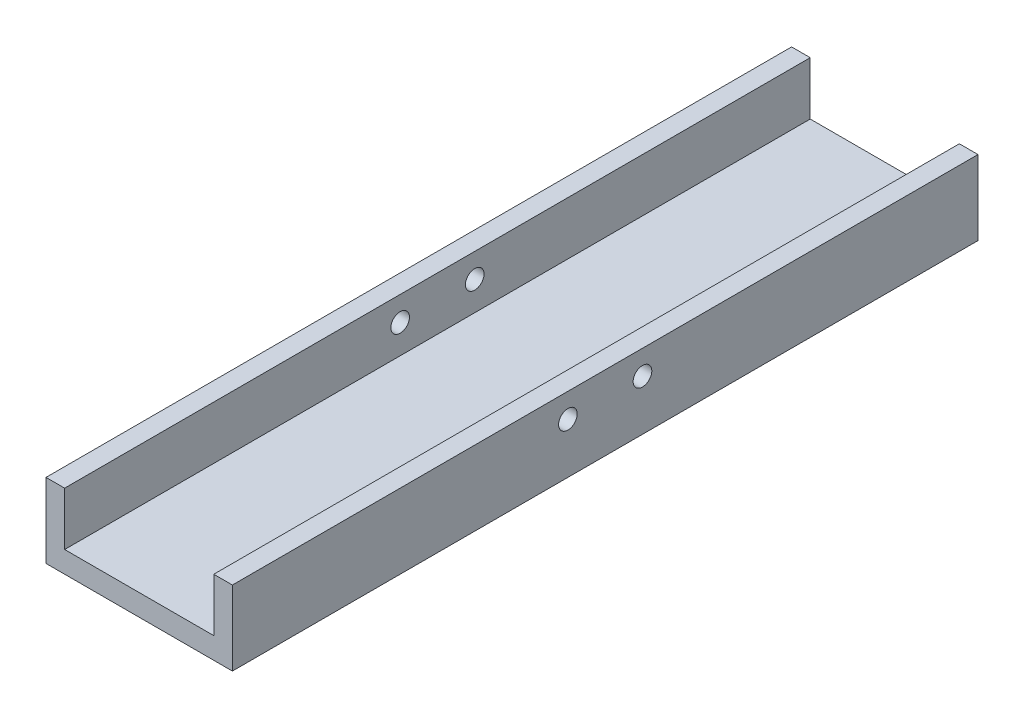
ISO-10303-21;
HEADER;
FILE_DESCRIPTION(('STEP AP214'),'2;1');
FILE_NAME('part.step','',(''),(''),'','','');
FILE_SCHEMA(('AUTOMOTIVE_DESIGN { 1 0 10303 214 1 1 1 1 }'));
ENDSEC;
DATA;
#1=APPLICATION_CONTEXT('core data for automotive mechanical design processes');
#2=APPLICATION_PROTOCOL_DEFINITION('international standard','automotive_design',2000,#1);
#3=PRODUCT_CONTEXT('',#1,'mechanical');
#4=PRODUCT('Part','Part','',(#3));
#5=PRODUCT_RELATED_PRODUCT_CATEGORY('part','',(#4));
#6=PRODUCT_DEFINITION_FORMATION('','',#4);
#7=PRODUCT_DEFINITION_CONTEXT('part definition',#1,'design');
#8=PRODUCT_DEFINITION('design','',#6,#7);
#9=PRODUCT_DEFINITION_SHAPE('','',#8);
#10=(LENGTH_UNIT() NAMED_UNIT(*) SI_UNIT(.MILLI.,.METRE.));
#11=(NAMED_UNIT(*) PLANE_ANGLE_UNIT() SI_UNIT($,.RADIAN.));
#12=(NAMED_UNIT(*) SI_UNIT($,.STERADIAN.) SOLID_ANGLE_UNIT());
#13=UNCERTAINTY_MEASURE_WITH_UNIT(LENGTH_MEASURE(1.E-05),#10,'distance_accuracy_value','');
#14=(GEOMETRIC_REPRESENTATION_CONTEXT(3) GLOBAL_UNCERTAINTY_ASSIGNED_CONTEXT((#13)) GLOBAL_UNIT_ASSIGNED_CONTEXT((#10,
#11,#12)) REPRESENTATION_CONTEXT('',''));
#15=CARTESIAN_POINT('',(0.,0.,0.));
#16=DIRECTION('',(0.,0.,1.));
#17=DIRECTION('',(1.,0.,0.));
#18=AXIS2_PLACEMENT_3D('',#15,#16,#17);
#19=CARTESIAN_POINT('',(-4.65787214121234,4.25514792018293,200.));
#20=DIRECTION('',(0.,-1.,0.));
#21=DIRECTION('',(0.,0.,-1.));
#22=AXIS2_PLACEMENT_3D('',#19,#20,#21);
#23=PLANE('',#22);
#24=DIRECTION('',(-1.,0.,0.));
#25=VECTOR('',#24,1.);
#26=CARTESIAN_POINT('',(-4.65787214121234,4.25514792018293,0.));
#27=LINE('',#26,#25);
#28=CARTESIAN_POINT('',(45.3421278587877,4.25514792018293,0.));
#29=VERTEX_POINT('',#28);
#30=CARTESIAN_POINT('',(40.3421278587877,4.25514792018293,0.));
#31=VERTEX_POINT('',#30);
#32=EDGE_CURVE('E183',#29,#31,#27,.T.);
#33=ORIENTED_EDGE('',*,*,#32,.T.);
#34=DIRECTION('',(0.,0.,1.));
#35=VECTOR('',#34,1.);
#36=CARTESIAN_POINT('',(40.3421278587877,4.25514792018293,200.));
#37=LINE('',#36,#35);
#38=CARTESIAN_POINT('',(40.3421278587877,4.25514792018293,200.));
#39=VERTEX_POINT('',#38);
#40=EDGE_CURVE('E159',#31,#39,#37,.T.);
#41=ORIENTED_EDGE('',*,*,#40,.T.);
#42=DIRECTION('',(-1.,0.,0.));
#43=VECTOR('',#42,1.);
#44=CARTESIAN_POINT('',(-4.65787214121234,4.25514792018293,200.));
#45=LINE('',#44,#43);
#46=CARTESIAN_POINT('',(45.3421278587877,4.25514792018293,200.));
#47=VERTEX_POINT('',#46);
#48=EDGE_CURVE('E189',#47,#39,#45,.T.);
#49=ORIENTED_EDGE('',*,*,#48,.F.);
#50=DIRECTION('',(0.,0.,-1.));
#51=VECTOR('',#50,1.);
#52=CARTESIAN_POINT('',(45.3421278587877,4.25514792018293,200.));
#53=LINE('',#52,#51);
#54=EDGE_CURVE('E208',#47,#29,#53,.T.);
#55=ORIENTED_EDGE('',*,*,#54,.T.);
#56=EDGE_LOOP('',(#33,#41,#49,#55));
#57=FACE_BOUND('',#56,.T.);
#58=ADVANCED_FACE('F41',(#57),#23,.F.);
#59=CARTESIAN_POINT('',(-4.65787214121234,-2.24485207981707,110.));
#60=DIRECTION('',(1.,0.,0.));
#61=DIRECTION('',(0.,0.,-1.));
#62=AXIS2_PLACEMENT_3D('',#59,#60,#61);
#63=CYLINDRICAL_SURFACE('',#62,2.5);
#64=CARTESIAN_POINT('',(40.3421278587877,-2.24485207981707,110.));
#65=DIRECTION('',(1.,0.,0.));
#66=DIRECTION('',(0.,0.,-1.));
#67=AXIS2_PLACEMENT_3D('',#64,#65,#66);
#68=CIRCLE('',#67,2.5);
#69=CARTESIAN_POINT('',(40.3421278587877,-2.24485207981707,107.5));
#70=VERTEX_POINT('',#69);
#71=EDGE_CURVE('E155',#70,#70,#68,.F.);
#72=ORIENTED_EDGE('',*,*,#71,.T.);
#73=EDGE_LOOP('',(#72));
#74=FACE_BOUND('',#73,.T.);
#75=CARTESIAN_POINT('',(45.3421278587877,-2.24485207981707,110.));
#76=DIRECTION('',(1.,0.,0.));
#77=DIRECTION('',(0.,0.,-1.));
#78=AXIS2_PLACEMENT_3D('',#75,#76,#77);
#79=CIRCLE('',#78,2.5);
#80=CARTESIAN_POINT('',(45.3421278587877,-2.24485207981707,107.5));
#81=VERTEX_POINT('',#80);
#82=EDGE_CURVE('E163',#81,#81,#79,.T.);
#83=ORIENTED_EDGE('',*,*,#82,.T.);
#84=EDGE_LOOP('',(#83));
#85=FACE_BOUND('',#84,.T.);
#86=ADVANCED_FACE('F255',(#74,#85),#63,.F.);
#87=CARTESIAN_POINT('',(-4.65787214121234,-2.24485207981707,90.));
#88=DIRECTION('',(1.,0.,0.));
#89=DIRECTION('',(0.,0.,-1.));
#90=AXIS2_PLACEMENT_3D('',#87,#88,#89);
#91=CYLINDRICAL_SURFACE('',#90,2.5);
#92=CARTESIAN_POINT('',(40.3421278587877,-2.24485207981707,90.));
#93=DIRECTION('',(1.,0.,0.));
#94=DIRECTION('',(0.,0.,-1.));
#95=AXIS2_PLACEMENT_3D('',#92,#93,#94);
#96=CIRCLE('',#95,2.5);
#97=CARTESIAN_POINT('',(40.3421278587877,-2.24485207981707,87.5));
#98=VERTEX_POINT('',#97);
#99=EDGE_CURVE('E45',#98,#98,#96,.F.);
#100=ORIENTED_EDGE('',*,*,#99,.T.);
#101=EDGE_LOOP('',(#100));
#102=FACE_BOUND('',#101,.T.);
#103=CARTESIAN_POINT('',(45.3421278587877,-2.24485207981707,90.));
#104=DIRECTION('',(1.,0.,0.));
#105=DIRECTION('',(0.,0.,-1.));
#106=AXIS2_PLACEMENT_3D('',#103,#104,#105);
#107=CIRCLE('',#106,2.5);
#108=CARTESIAN_POINT('',(45.3421278587877,-2.24485207981707,87.5));
#109=VERTEX_POINT('',#108);
#110=EDGE_CURVE('E164',#109,#109,#107,.T.);
#111=ORIENTED_EDGE('',*,*,#110,.T.);
#112=EDGE_LOOP('',(#111));
#113=FACE_BOUND('',#112,.T.);
#114=ADVANCED_FACE('F246',(#102,#113),#91,.F.);
#115=CARTESIAN_POINT('',(-4.65787214121234,-15.7448520798171,200.));
#116=DIRECTION('',(1.,0.,0.));
#117=DIRECTION('',(0.,0.,-1.));
#118=AXIS2_PLACEMENT_3D('',#115,#116,#117);
#119=PLANE('',#118);
#120=CARTESIAN_POINT('',(-4.65787214121234,-2.24485207981707,90.));
#121=DIRECTION('',(1.,0.,0.));
#122=DIRECTION('',(0.,0.,-1.));
#123=AXIS2_PLACEMENT_3D('',#120,#121,#122);
#124=CIRCLE('',#123,2.5);
#125=CARTESIAN_POINT('',(-4.65787214121234,-2.24485207981707,87.5));
#126=VERTEX_POINT('',#125);
#127=EDGE_CURVE('E168',#126,#126,#124,.T.);
#128=ORIENTED_EDGE('',*,*,#127,.T.);
#129=EDGE_LOOP('',(#128));
#130=FACE_BOUND('',#129,.T.);
#131=CARTESIAN_POINT('',(-4.65787214121234,-2.24485207981707,110.));
#132=DIRECTION('',(1.,0.,0.));
#133=DIRECTION('',(0.,0.,-1.));
#134=AXIS2_PLACEMENT_3D('',#131,#132,#133);
#135=CIRCLE('',#134,2.5);
#136=CARTESIAN_POINT('',(-4.65787214121234,-2.24485207981707,107.5));
#137=VERTEX_POINT('',#136);
#138=EDGE_CURVE('E169',#137,#137,#135,.T.);
#139=ORIENTED_EDGE('',*,*,#138,.T.);
#140=EDGE_LOOP('',(#139));
#141=FACE_BOUND('',#140,.T.);
#142=DIRECTION('',(0.,-1.,0.));
#143=VECTOR('',#142,1.);
#144=CARTESIAN_POINT('',(-4.65787214121234,-15.7448520798171,0.));
#145=LINE('',#144,#143);
#146=CARTESIAN_POINT('',(-4.65787214121234,4.25514792018293,0.));
#147=VERTEX_POINT('',#146);
#148=CARTESIAN_POINT('',(-4.65787214121234,-15.7448520798171,0.));
#149=VERTEX_POINT('',#148);
#150=EDGE_CURVE('E173',#147,#149,#145,.T.);
#151=ORIENTED_EDGE('',*,*,#150,.T.);
#152=DIRECTION('',(0.,0.,-1.));
#153=VECTOR('',#152,1.);
#154=CARTESIAN_POINT('',(-4.65787214121234,-15.7448520798171,200.));
#155=LINE('',#154,#153);
#156=CARTESIAN_POINT('',(-4.65787214121234,-15.7448520798171,200.));
#157=VERTEX_POINT('',#156);
#158=EDGE_CURVE('E11',#157,#149,#155,.T.);
#159=ORIENTED_EDGE('',*,*,#158,.F.);
#160=DIRECTION('',(0.,-1.,0.));
#161=VECTOR('',#160,1.);
#162=CARTESIAN_POINT('',(-4.65787214121234,-15.7448520798171,200.));
#163=LINE('',#162,#161);
#164=CARTESIAN_POINT('',(-4.65787214121234,4.25514792018293,200.));
#165=VERTEX_POINT('',#164);
#166=EDGE_CURVE('E180',#165,#157,#163,.T.);
#167=ORIENTED_EDGE('',*,*,#166,.F.);
#168=DIRECTION('',(0.,0.,-1.));
#169=VECTOR('',#168,1.);
#170=CARTESIAN_POINT('',(-4.65787214121234,4.25514792018293,200.));
#171=LINE('',#170,#169);
#172=EDGE_CURVE('E193',#165,#147,#171,.T.);
#173=ORIENTED_EDGE('',*,*,#172,.T.);
#174=EDGE_LOOP('',(#151,#159,#167,#173));
#175=FACE_BOUND('',#174,.T.);
#176=ADVANCED_FACE('F43',(#130,#141,#175),#119,.F.);
#177=CARTESIAN_POINT('',(-4.65787214121234,-15.7448520798171,200.));
#178=DIRECTION('',(0.,1.,0.));
#179=DIRECTION('',(0.,0.,1.));
#180=AXIS2_PLACEMENT_3D('',#177,#178,#179);
#181=PLANE('',#180);
#182=DIRECTION('',(1.,0.,0.));
#183=VECTOR('',#182,1.);
#184=CARTESIAN_POINT('',(-4.65787214121234,-15.7448520798171,0.));
#185=LINE('',#184,#183);
#186=CARTESIAN_POINT('',(45.3421278587877,-15.7448520798171,0.));
#187=VERTEX_POINT('',#186);
#188=EDGE_CURVE('E197',#149,#187,#185,.T.);
#189=ORIENTED_EDGE('',*,*,#188,.T.);
#190=DIRECTION('',(0.,0.,-1.));
#191=VECTOR('',#190,1.);
#192=CARTESIAN_POINT('',(45.3421278587877,-15.7448520798171,200.));
#193=LINE('',#192,#191);
#194=CARTESIAN_POINT('',(45.3421278587877,-15.7448520798171,200.));
#195=VERTEX_POINT('',#194);
#196=EDGE_CURVE('E51',#195,#187,#193,.T.);
#197=ORIENTED_EDGE('',*,*,#196,.F.);
#198=DIRECTION('',(1.,0.,0.));
#199=VECTOR('',#198,1.);
#200=CARTESIAN_POINT('',(-4.65787214121234,-15.7448520798171,200.));
#201=LINE('',#200,#199);
#202=EDGE_CURVE('E97',#157,#195,#201,.T.);
#203=ORIENTED_EDGE('',*,*,#202,.F.);
#204=ORIENTED_EDGE('',*,*,#158,.T.);
#205=EDGE_LOOP('',(#189,#197,#203,#204));
#206=FACE_BOUND('',#205,.T.);
#207=ADVANCED_FACE('F235',(#206),#181,.F.);
#208=CARTESIAN_POINT('',(45.3421278587877,-15.7448520798171,200.));
#209=DIRECTION('',(-1.,0.,0.));
#210=DIRECTION('',(0.,0.,1.));
#211=AXIS2_PLACEMENT_3D('',#208,#209,#210);
#212=PLANE('',#211);
#213=ORIENTED_EDGE('',*,*,#110,.F.);
#214=EDGE_LOOP('',(#213));
#215=FACE_BOUND('',#214,.T.);
#216=ORIENTED_EDGE('',*,*,#82,.F.);
#217=EDGE_LOOP('',(#216));
#218=FACE_BOUND('',#217,.T.);
#219=DIRECTION('',(0.,1.,0.));
#220=VECTOR('',#219,1.);
#221=CARTESIAN_POINT('',(45.3421278587877,-15.7448520798171,0.));
#222=LINE('',#221,#220);
#223=EDGE_CURVE('E200',#187,#29,#222,.T.);
#224=ORIENTED_EDGE('',*,*,#223,.T.);
#225=ORIENTED_EDGE('',*,*,#54,.F.);
#226=DIRECTION('',(0.,1.,0.));
#227=VECTOR('',#226,1.);
#228=CARTESIAN_POINT('',(45.3421278587877,-15.7448520798171,200.));
#229=LINE('',#228,#227);
#230=EDGE_CURVE('E186',#195,#47,#229,.T.);
#231=ORIENTED_EDGE('',*,*,#230,.F.);
#232=ORIENTED_EDGE('',*,*,#196,.T.);
#233=EDGE_LOOP('',(#224,#225,#231,#232));
#234=FACE_BOUND('',#233,.T.);
#235=ADVANCED_FACE('F234',(#215,#218,#234),#212,.F.);
#236=CARTESIAN_POINT('',(0.342127858787663,4.25514792018293,200.));
#237=VERTEX_POINT('',#236);
#238=EDGE_CURVE('E68',#237,#165,#45,.T.);
#239=ORIENTED_EDGE('',*,*,#238,.F.);
#240=DIRECTION('',(0.,0.,-1.));
#241=VECTOR('',#240,1.);
#242=CARTESIAN_POINT('',(0.342127858787664,4.25514792018293,200.));
#243=LINE('',#242,#241);
#244=CARTESIAN_POINT('',(0.342127858787664,4.25514792018293,0.));
#245=VERTEX_POINT('',#244);
#246=EDGE_CURVE('E151',#237,#245,#243,.T.);
#247=ORIENTED_EDGE('',*,*,#246,.T.);
#248=EDGE_CURVE('E90',#245,#147,#27,.T.);
#249=ORIENTED_EDGE('',*,*,#248,.T.);
#250=ORIENTED_EDGE('',*,*,#172,.F.);
#251=EDGE_LOOP('',(#239,#247,#249,#250));
#252=FACE_BOUND('',#251,.T.);
#253=ADVANCED_FACE('F239',(#252),#23,.F.);
#254=CARTESIAN_POINT('',(0.,0.,200.));
#255=DIRECTION('',(0.,0.,-1.));
#256=DIRECTION('',(-1.,0.,0.));
#257=AXIS2_PLACEMENT_3D('',#254,#255,#256);
#258=PLANE('',#257);
#259=ORIENTED_EDGE('',*,*,#48,.T.);
#260=DIRECTION('',(0.,1.,0.));
#261=VECTOR('',#260,1.);
#262=CARTESIAN_POINT('',(40.3421278587877,-10.,200.));
#263=LINE('',#262,#261);
#264=CARTESIAN_POINT('',(40.3421278587877,-10.,200.));
#265=VERTEX_POINT('',#264);
#266=EDGE_CURVE('E142',#265,#39,#263,.T.);
#267=ORIENTED_EDGE('',*,*,#266,.F.);
#268=DIRECTION('',(1.,0.,0.));
#269=VECTOR('',#268,1.);
#270=CARTESIAN_POINT('',(40.3421278587877,-10.,200.));
#271=LINE('',#270,#269);
#272=CARTESIAN_POINT('',(0.342127858787663,-10.,200.));
#273=VERTEX_POINT('',#272);
#274=EDGE_CURVE('E126',#273,#265,#271,.T.);
#275=ORIENTED_EDGE('',*,*,#274,.F.);
#276=DIRECTION('',(0.,1.,0.));
#277=VECTOR('',#276,1.);
#278=CARTESIAN_POINT('',(0.342127858787663,-10.,200.));
#279=LINE('',#278,#277);
#280=EDGE_CURVE('E123',#273,#237,#279,.T.);
#281=ORIENTED_EDGE('',*,*,#280,.T.);
#282=ORIENTED_EDGE('',*,*,#238,.T.);
#283=ORIENTED_EDGE('',*,*,#166,.T.);
#284=ORIENTED_EDGE('',*,*,#202,.T.);
#285=ORIENTED_EDGE('',*,*,#230,.T.);
#286=EDGE_LOOP('',(#259,#267,#275,#281,#282,#283,#284,#285));
#287=FACE_BOUND('',#286,.T.);
#288=ADVANCED_FACE('F225',(#287),#258,.F.);
#289=CARTESIAN_POINT('',(0.,0.,0.));
#290=DIRECTION('',(0.,0.,-1.));
#291=DIRECTION('',(-1.,0.,0.));
#292=AXIS2_PLACEMENT_3D('',#289,#290,#291);
#293=PLANE('',#292);
#294=DIRECTION('',(0.,1.,0.));
#295=VECTOR('',#294,1.);
#296=CARTESIAN_POINT('',(40.3421278587877,-10.,0.));
#297=LINE('',#296,#295);
#298=CARTESIAN_POINT('',(40.3421278587877,-10.,0.));
#299=VERTEX_POINT('',#298);
#300=EDGE_CURVE('E138',#299,#31,#297,.T.);
#301=ORIENTED_EDGE('',*,*,#300,.T.);
#302=ORIENTED_EDGE('',*,*,#32,.F.);
#303=ORIENTED_EDGE('',*,*,#223,.F.);
#304=ORIENTED_EDGE('',*,*,#188,.F.);
#305=ORIENTED_EDGE('',*,*,#150,.F.);
#306=ORIENTED_EDGE('',*,*,#248,.F.);
#307=DIRECTION('',(0.,1.,0.));
#308=VECTOR('',#307,1.);
#309=CARTESIAN_POINT('',(0.342127858787664,-10.,0.));
#310=LINE('',#309,#308);
#311=CARTESIAN_POINT('',(0.342127858787664,-10.,0.));
#312=VERTEX_POINT('',#311);
#313=EDGE_CURVE('E122',#312,#245,#310,.T.);
#314=ORIENTED_EDGE('',*,*,#313,.F.);
#315=DIRECTION('',(-1.,0.,0.));
#316=VECTOR('',#315,1.);
#317=CARTESIAN_POINT('',(40.3421278587877,-10.,0.));
#318=LINE('',#317,#316);
#319=EDGE_CURVE('E127',#299,#312,#318,.T.);
#320=ORIENTED_EDGE('',*,*,#319,.F.);
#321=EDGE_LOOP('',(#301,#302,#303,#304,#305,#306,#314,#320));
#322=FACE_BOUND('',#321,.T.);
#323=ADVANCED_FACE('F135',(#322),#293,.T.);
#324=CARTESIAN_POINT('',(0.342127858787664,-2.24485207981707,110.));
#325=DIRECTION('',(-1.,0.,0.));
#326=DIRECTION('',(0.,0.,1.));
#327=AXIS2_PLACEMENT_3D('',#324,#325,#326);
#328=CIRCLE('',#327,2.5);
#329=CARTESIAN_POINT('',(0.342127858787664,-2.24485207981707,112.5));
#330=VERTEX_POINT('',#329);
#331=EDGE_CURVE('E147',#330,#330,#328,.F.);
#332=ORIENTED_EDGE('',*,*,#331,.T.);
#333=EDGE_LOOP('',(#332));
#334=FACE_BOUND('',#333,.T.);
#335=ORIENTED_EDGE('',*,*,#138,.F.);
#336=EDGE_LOOP('',(#335));
#337=FACE_BOUND('',#336,.T.);
#338=ADVANCED_FACE('F259',(#334,#337),#63,.F.);
#339=CARTESIAN_POINT('',(0.342127858787664,-2.24485207981707,90.));
#340=DIRECTION('',(-1.,0.,0.));
#341=DIRECTION('',(0.,0.,1.));
#342=AXIS2_PLACEMENT_3D('',#339,#340,#341);
#343=CIRCLE('',#342,2.5);
#344=CARTESIAN_POINT('',(0.342127858787664,-2.24485207981707,92.5));
#345=VERTEX_POINT('',#344);
#346=EDGE_CURVE('E152',#345,#345,#343,.F.);
#347=ORIENTED_EDGE('',*,*,#346,.T.);
#348=EDGE_LOOP('',(#347));
#349=FACE_BOUND('',#348,.T.);
#350=ORIENTED_EDGE('',*,*,#127,.F.);
#351=EDGE_LOOP('',(#350));
#352=FACE_BOUND('',#351,.T.);
#353=ADVANCED_FACE('F251',(#349,#352),#91,.F.);
#354=CARTESIAN_POINT('',(40.3421278587877,-10.,200.));
#355=DIRECTION('',(1.,0.,0.));
#356=DIRECTION('',(0.,0.,-1.));
#357=AXIS2_PLACEMENT_3D('',#354,#355,#356);
#358=PLANE('',#357);
#359=ORIENTED_EDGE('',*,*,#99,.F.);
#360=EDGE_LOOP('',(#359));
#361=FACE_BOUND('',#360,.T.);
#362=ORIENTED_EDGE('',*,*,#71,.F.);
#363=EDGE_LOOP('',(#362));
#364=FACE_BOUND('',#363,.T.);
#365=ORIENTED_EDGE('',*,*,#300,.F.);
#366=DIRECTION('',(0.,0.,-1.));
#367=VECTOR('',#366,1.);
#368=CARTESIAN_POINT('',(40.3421278587877,-10.,200.));
#369=LINE('',#368,#367);
#370=EDGE_CURVE('E59',#265,#299,#369,.T.);
#371=ORIENTED_EDGE('',*,*,#370,.F.);
#372=ORIENTED_EDGE('',*,*,#266,.T.);
#373=ORIENTED_EDGE('',*,*,#40,.F.);
#374=EDGE_LOOP('',(#365,#371,#372,#373));
#375=FACE_BOUND('',#374,.T.);
#376=ADVANCED_FACE('F231',(#361,#364,#375),#358,.F.);
#377=CARTESIAN_POINT('',(0.342127858787663,-10.,200.));
#378=DIRECTION('',(-1.,0.,0.));
#379=DIRECTION('',(0.,0.,1.));
#380=AXIS2_PLACEMENT_3D('',#377,#378,#379);
#381=PLANE('',#380);
#382=ORIENTED_EDGE('',*,*,#346,.F.);
#383=EDGE_LOOP('',(#382));
#384=FACE_BOUND('',#383,.T.);
#385=ORIENTED_EDGE('',*,*,#331,.F.);
#386=EDGE_LOOP('',(#385));
#387=FACE_BOUND('',#386,.T.);
#388=ORIENTED_EDGE('',*,*,#280,.F.);
#389=DIRECTION('',(0.,0.,1.));
#390=VECTOR('',#389,1.);
#391=CARTESIAN_POINT('',(0.342127858787663,-10.,200.));
#392=LINE('',#391,#390);
#393=EDGE_CURVE('E119',#312,#273,#392,.T.);
#394=ORIENTED_EDGE('',*,*,#393,.F.);
#395=ORIENTED_EDGE('',*,*,#313,.T.);
#396=ORIENTED_EDGE('',*,*,#246,.F.);
#397=EDGE_LOOP('',(#388,#394,#395,#396));
#398=FACE_BOUND('',#397,.T.);
#399=ADVANCED_FACE('F120',(#384,#387,#398),#381,.F.);
#400=CARTESIAN_POINT('',(0.,-10.,0.));
#401=DIRECTION('',(0.,1.,0.));
#402=DIRECTION('',(0.,0.,1.));
#403=AXIS2_PLACEMENT_3D('',#400,#401,#402);
#404=PLANE('',#403);
#405=ORIENTED_EDGE('',*,*,#370,.T.);
#406=ORIENTED_EDGE('',*,*,#319,.T.);
#407=ORIENTED_EDGE('',*,*,#393,.T.);
#408=ORIENTED_EDGE('',*,*,#274,.T.);
#409=EDGE_LOOP('',(#405,#406,#407,#408));
#410=FACE_BOUND('',#409,.T.);
#411=ADVANCED_FACE('F130',(#410),#404,.T.);
#412=CLOSED_SHELL('',(#58,#86,#114,#176,#207,#235,#253,#288,#323,#338,#353,#376,#399,#411));
#413=MANIFOLD_SOLID_BREP('B2',#412);
#414=ADVANCED_BREP_SHAPE_REPRESENTATION('',(#18,#413),#14);
#415=SHAPE_DEFINITION_REPRESENTATION(#9,#414);
ENDSEC;
END-ISO-10303-21;
